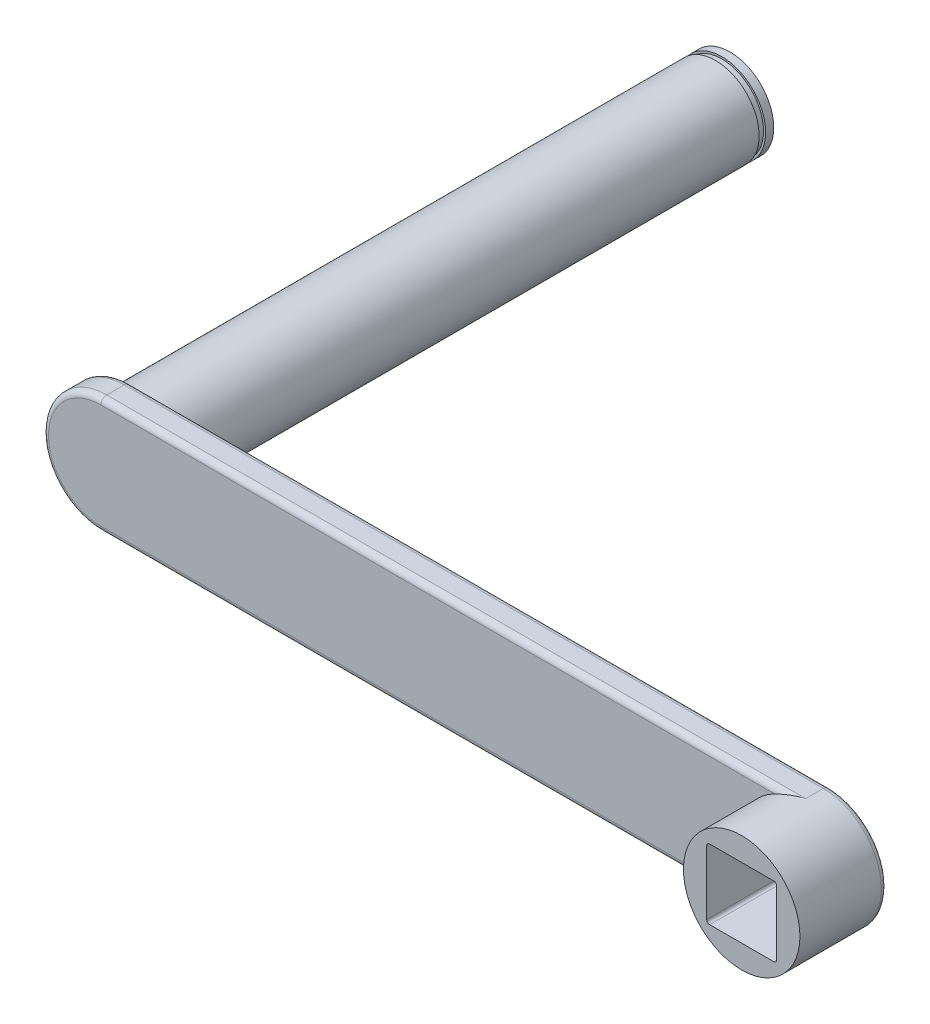
ISO-10303-21;
HEADER;
FILE_DESCRIPTION(('STEP AP214'),'2;1');
FILE_NAME('part.step','',(''),(''),'','','');
FILE_SCHEMA(('AUTOMOTIVE_DESIGN { 1 0 10303 214 1 1 1 1 }'));
ENDSEC;
DATA;
#1=APPLICATION_CONTEXT('core data for automotive mechanical design processes');
#2=APPLICATION_PROTOCOL_DEFINITION('international standard','automotive_design',2000,#1);
#3=PRODUCT_CONTEXT('',#1,'mechanical');
#4=PRODUCT('Part','Part','',(#3));
#5=PRODUCT_RELATED_PRODUCT_CATEGORY('part','',(#4));
#6=PRODUCT_DEFINITION_FORMATION('','',#4);
#7=PRODUCT_DEFINITION_CONTEXT('part definition',#1,'design');
#8=PRODUCT_DEFINITION('design','',#6,#7);
#9=PRODUCT_DEFINITION_SHAPE('','',#8);
#10=(LENGTH_UNIT() NAMED_UNIT(*) SI_UNIT(.MILLI.,.METRE.));
#11=(NAMED_UNIT(*) PLANE_ANGLE_UNIT() SI_UNIT($,.RADIAN.));
#12=(NAMED_UNIT(*) SI_UNIT($,.STERADIAN.) SOLID_ANGLE_UNIT());
#13=UNCERTAINTY_MEASURE_WITH_UNIT(LENGTH_MEASURE(1.E-05),#10,'distance_accuracy_value','');
#14=(GEOMETRIC_REPRESENTATION_CONTEXT(3) GLOBAL_UNCERTAINTY_ASSIGNED_CONTEXT((#13)) GLOBAL_UNIT_ASSIGNED_CONTEXT((#10,
#11,#12)) REPRESENTATION_CONTEXT('',''));
#15=CARTESIAN_POINT('',(0.,0.,0.));
#16=DIRECTION('',(0.,0.,1.));
#17=DIRECTION('',(1.,0.,0.));
#18=AXIS2_PLACEMENT_3D('',#15,#16,#17);
#19=CARTESIAN_POINT('',(-120.,0.,-113.));
#20=DIRECTION('',(0.,0.,1.));
#21=DIRECTION('',(1.,0.,0.));
#22=AXIS2_PLACEMENT_3D('',#19,#20,#21);
#23=CYLINDRICAL_SURFACE('',#22,7.5);
#24=CARTESIAN_POINT('',(-120.,0.,-10.));
#25=DIRECTION('',(0.,0.,-1.));
#26=DIRECTION('',(-1.,0.,0.));
#27=AXIS2_PLACEMENT_3D('',#24,#25,#26);
#28=CIRCLE('',#27,7.5);
#29=CARTESIAN_POINT('',(-127.5,0.,-10.));
#30=VERTEX_POINT('',#29);
#31=EDGE_CURVE('E437',#30,#30,#28,.T.);
#32=ORIENTED_EDGE('',*,*,#31,.T.);
#33=EDGE_LOOP('',(#32));
#34=FACE_BOUND('',#33,.T.);
#35=CARTESIAN_POINT('',(-120.,0.,-110.5));
#36=DIRECTION('',(0.,0.,-1.));
#37=DIRECTION('',(-1.,0.,0.));
#38=AXIS2_PLACEMENT_3D('',#35,#36,#37);
#39=CIRCLE('',#38,7.5);
#40=CARTESIAN_POINT('',(-127.5,0.,-110.5));
#41=VERTEX_POINT('',#40);
#42=EDGE_CURVE('E280',#41,#41,#39,.T.);
#43=ORIENTED_EDGE('',*,*,#42,.F.);
#44=EDGE_LOOP('',(#43));
#45=FACE_BOUND('',#44,.T.);
#46=ADVANCED_FACE('F18',(#34,#45),#23,.T.);
#47=CARTESIAN_POINT('',(0.,0.,5.));
#48=DIRECTION('',(0.,0.,-1.));
#49=DIRECTION('',(-1.,0.,0.));
#50=AXIS2_PLACEMENT_3D('',#47,#48,#49);
#51=CYLINDRICAL_SURFACE('',#50,10.);
#52=CARTESIAN_POINT('',(0.,0.,5.));
#53=DIRECTION('',(0.,0.,1.));
#54=DIRECTION('',(1.,0.,0.));
#55=AXIS2_PLACEMENT_3D('',#52,#53,#54);
#56=CIRCLE('',#55,10.);
#57=CARTESIAN_POINT('',(10.,0.,5.));
#58=VERTEX_POINT('',#57);
#59=EDGE_CURVE('E450',#58,#58,#56,.T.);
#60=ORIENTED_EDGE('',*,*,#59,.F.);
#61=EDGE_LOOP('',(#60));
#62=FACE_BOUND('',#61,.T.);
#63=DIRECTION('',(0.,0.,1.));
#64=VECTOR('',#63,1.);
#65=CARTESIAN_POINT('',(0.,-10.,-10.));
#66=LINE('',#65,#64);
#67=CARTESIAN_POINT('',(0.,-10.,-9.));
#68=VERTEX_POINT('',#67);
#69=CARTESIAN_POINT('',(0.,-10.,-6.));
#70=VERTEX_POINT('',#69);
#71=EDGE_CURVE('E427',#68,#70,#66,.T.);
#72=ORIENTED_EDGE('',*,*,#71,.F.);
#73=CARTESIAN_POINT('',(0.,0.,-9.));
#74=DIRECTION('',(0.,0.,-1.));
#75=DIRECTION('',(-1.,0.,0.));
#76=AXIS2_PLACEMENT_3D('',#73,#74,#75);
#77=CIRCLE('',#76,10.);
#78=CARTESIAN_POINT('',(0.,10.,-9.));
#79=VERTEX_POINT('',#78);
#80=EDGE_CURVE('E142',#68,#79,#77,.F.);
#81=ORIENTED_EDGE('',*,*,#80,.T.);
#82=DIRECTION('',(0.,0.,1.));
#83=VECTOR('',#82,1.);
#84=CARTESIAN_POINT('',(0.,10.,-10.));
#85=LINE('',#84,#83);
#86=CARTESIAN_POINT('',(0.,10.,-6.));
#87=VERTEX_POINT('',#86);
#88=EDGE_CURVE('E425',#79,#87,#85,.T.);
#89=ORIENTED_EDGE('',*,*,#88,.T.);
#90=CARTESIAN_POINT('',(-4.35889894354067,9.,-5.));
#91=CARTESIAN_POINT('',(-4.2865764647807,9.03502940811181,-5.00001517907888));
#92=CARTESIAN_POINT('',(-4.21384835584695,9.06917502615788,-5.00183974990828));
#93=CARTESIAN_POINT('',(-4.06774424773403,9.13563818238745,-5.00867500405916));
#94=CARTESIAN_POINT('',(-3.99436853902,9.16795649634285,-5.01368432408378));
#95=CARTESIAN_POINT('',(-3.84721416016159,9.23067336525732,-5.02644469931919));
#96=CARTESIAN_POINT('',(-3.77343655523181,9.26107554197173,-5.03419038738089));
#97=CARTESIAN_POINT('',(-3.62542416890267,9.32001323089674,-5.05208658188006));
#98=CARTESIAN_POINT('',(-3.55118933283647,9.34854851496683,-5.06223738153229));
#99=CARTESIAN_POINT('',(-3.32854256185863,9.43110737250037,-5.09574919733705));
#100=CARTESIAN_POINT('',(-3.17955672275789,9.482352688623,-5.12222969644671));
#101=CARTESIAN_POINT('',(-2.88046339838335,9.57745203655493,-5.18165298985508));
#102=CARTESIAN_POINT('',(-2.73035525497286,9.62130130647466,-5.21459991820859));
#103=CARTESIAN_POINT('',(-2.36825595348038,9.71798906645472,-5.29987772594522));
#104=CARTESIAN_POINT('',(-2.15587492358611,9.76725305405501,-5.3546487046353));
#105=CARTESIAN_POINT('',(-1.73020697131338,9.85157380993527,-5.47087286474005));
#106=CARTESIAN_POINT('',(-1.5169199178877,9.88662844700476,-5.53232704679307));
#107=CARTESIAN_POINT('',(-0.876019504349692,9.97086857638157,-5.72300296786544));
#108=CARTESIAN_POINT('',(-0.447232906354945,9.99916563253545,-5.858572887852));
#109=CARTESIAN_POINT('',(-0.0127126995627137,9.99999393532312,-5.99597991124585));
#110=CARTESIAN_POINT('',(-0.0063562775510455,9.99999999552881,-5.99798998882368));
#111=CARTESIAN_POINT('',(0.,10.,-6.));
#112=B_SPLINE_CURVE_WITH_KNOTS('',3,(#90,#91,#92,#93,#94,#95,#96,#97,#98,#99,#100,#101,#102,
#103,#104,#105,#106,#107,#108,#109,#110,#111),.UNSPECIFIED.,.F.,.F.,(4,2,2,2,2,2,2,2,2,2,4),(0.,
0.241022397911197,0.481941690674284,0.722391040963471,0.962869720289632,1.44176483881819,
1.92096712310372,2.59465687968437,3.26844764326604,4.61560355969885,4.63560356796335),.UNSPECIFIED.);
#113=CARTESIAN_POINT('',(-4.35889894354067,9.,-5.));
#114=VERTEX_POINT('',#113);
#115=EDGE_CURVE('E203',#87,#114,#112,.F.);
#116=ORIENTED_EDGE('',*,*,#115,.T.);
#117=CARTESIAN_POINT('',(0.,0.,-5.));
#118=DIRECTION('',(0.,0.,-1.));
#119=DIRECTION('',(-1.,0.,0.));
#120=AXIS2_PLACEMENT_3D('',#117,#118,#119);
#121=CIRCLE('',#120,10.);
#122=CARTESIAN_POINT('',(-4.35889894354067,-9.,-5.));
#123=VERTEX_POINT('',#122);
#124=EDGE_CURVE('E446',#123,#114,#121,.T.);
#125=ORIENTED_EDGE('',*,*,#124,.F.);
#126=CARTESIAN_POINT('',(-4.35889894354067,-9.,-5.));
#127=CARTESIAN_POINT('',(-4.2865764647807,-9.03502940811181,-5.00001517907888));
#128=CARTESIAN_POINT('',(-4.21384835584695,-9.06917502615788,-5.00183974990828));
#129=CARTESIAN_POINT('',(-4.06774424773403,-9.13563818238745,-5.00867500405916));
#130=CARTESIAN_POINT('',(-3.99436853902,-9.16795649634285,-5.01368432408378));
#131=CARTESIAN_POINT('',(-3.84721416016159,-9.23067336525732,-5.02644469931919));
#132=CARTESIAN_POINT('',(-3.77343655523181,-9.26107554197173,-5.03419038738089));
#133=CARTESIAN_POINT('',(-3.62542416890267,-9.32001323089674,-5.05208658188006));
#134=CARTESIAN_POINT('',(-3.55118933283647,-9.34854851496683,-5.06223738153229));
#135=CARTESIAN_POINT('',(-3.32854256185863,-9.43110737250037,-5.09574919733705));
#136=CARTESIAN_POINT('',(-3.17955672275789,-9.482352688623,-5.12222969644671));
#137=CARTESIAN_POINT('',(-2.88046339838335,-9.57745203655493,-5.18165298985508));
#138=CARTESIAN_POINT('',(-2.73035525497286,-9.62130130647466,-5.21459991820859));
#139=CARTESIAN_POINT('',(-2.36825595348038,-9.71798906645472,-5.29987772594522));
#140=CARTESIAN_POINT('',(-2.15587492358611,-9.76725305405501,-5.3546487046353));
#141=CARTESIAN_POINT('',(-1.73020697131338,-9.85157380993527,-5.47087286474005));
#142=CARTESIAN_POINT('',(-1.5169199178877,-9.88662844700476,-5.53232704679307));
#143=CARTESIAN_POINT('',(-0.876019504349692,-9.97086857638157,-5.72300296786544));
#144=CARTESIAN_POINT('',(-0.447232906354945,-9.99916563253545,-5.858572887852));
#145=CARTESIAN_POINT('',(-0.0127126995627137,-9.99999393532312,-5.99597991124585));
#146=CARTESIAN_POINT('',(-0.0063562775510455,-9.99999999552881,-5.99798998882368));
#147=CARTESIAN_POINT('',(0.,-10.,-6.));
#148=B_SPLINE_CURVE_WITH_KNOTS('',3,(#126,#127,#128,#129,#130,#131,#132,#133,#134,#135,#136,
#137,#138,#139,#140,#141,#142,#143,#144,#145,#146,#147),.UNSPECIFIED.,.F.,.F.,(4,2,2,2,2,2,2,2,
2,2,4),(0.,0.241022397911197,0.481941690674284,0.722391040963471,0.962869720289632,
1.44176483881819,1.92096712310372,2.59465687968437,3.26844764326604,4.61560355969885,
4.63560356796335),.UNSPECIFIED.);
#149=EDGE_CURVE('E212',#123,#70,#148,.T.);
#150=ORIENTED_EDGE('',*,*,#149,.T.);
#151=EDGE_LOOP('',(#72,#81,#89,#116,#125,#150));
#152=FACE_BOUND('',#151,.T.);
#153=ADVANCED_FACE('F222',(#62,#152),#51,.T.);
#154=CARTESIAN_POINT('',(0.,0.,5.));
#155=DIRECTION('',(0.,0.,1.));
#156=DIRECTION('',(1.,0.,0.));
#157=AXIS2_PLACEMENT_3D('',#154,#155,#156);
#158=PLANE('',#157);
#159=DIRECTION('',(0.,1.,0.));
#160=VECTOR('',#159,1.);
#161=CARTESIAN_POINT('',(6.,-6.,5.));
#162=LINE('',#161,#160);
#163=CARTESIAN_POINT('',(6.,-5.5,5.));
#164=VERTEX_POINT('',#163);
#165=CARTESIAN_POINT('',(6.,5.5,5.));
#166=VERTEX_POINT('',#165);
#167=EDGE_CURVE('E279',#164,#166,#162,.T.);
#168=ORIENTED_EDGE('',*,*,#167,.F.);
#169=CARTESIAN_POINT('',(5.5,-5.5,5.));
#170=DIRECTION('',(0.,0.,1.));
#171=DIRECTION('',(1.,0.,0.));
#172=AXIS2_PLACEMENT_3D('',#169,#170,#171);
#173=CIRCLE('',#172,0.5);
#174=CARTESIAN_POINT('',(5.5,-6.,5.));
#175=VERTEX_POINT('',#174);
#176=EDGE_CURVE('E43',#164,#175,#173,.F.);
#177=ORIENTED_EDGE('',*,*,#176,.T.);
#178=DIRECTION('',(1.,0.,0.));
#179=VECTOR('',#178,1.);
#180=CARTESIAN_POINT('',(-6.,-6.,5.));
#181=LINE('',#180,#179);
#182=CARTESIAN_POINT('',(-5.5,-6.,5.));
#183=VERTEX_POINT('',#182);
#184=EDGE_CURVE('E406',#183,#175,#181,.T.);
#185=ORIENTED_EDGE('',*,*,#184,.F.);
#186=CARTESIAN_POINT('',(-5.5,-5.5,5.));
#187=DIRECTION('',(0.,0.,1.));
#188=DIRECTION('',(1.,0.,0.));
#189=AXIS2_PLACEMENT_3D('',#186,#187,#188);
#190=CIRCLE('',#189,0.5);
#191=CARTESIAN_POINT('',(-6.,-5.5,5.));
#192=VERTEX_POINT('',#191);
#193=EDGE_CURVE('E354',#183,#192,#190,.F.);
#194=ORIENTED_EDGE('',*,*,#193,.T.);
#195=DIRECTION('',(0.,-1.,0.));
#196=VECTOR('',#195,1.);
#197=CARTESIAN_POINT('',(-6.,-6.,5.));
#198=LINE('',#197,#196);
#199=CARTESIAN_POINT('',(-6.,5.5,5.));
#200=VERTEX_POINT('',#199);
#201=EDGE_CURVE('E654',#200,#192,#198,.T.);
#202=ORIENTED_EDGE('',*,*,#201,.F.);
#203=CARTESIAN_POINT('',(-5.5,5.5,5.));
#204=DIRECTION('',(0.,0.,1.));
#205=DIRECTION('',(1.,0.,0.));
#206=AXIS2_PLACEMENT_3D('',#203,#204,#205);
#207=CIRCLE('',#206,0.5);
#208=CARTESIAN_POINT('',(-5.5,6.,5.));
#209=VERTEX_POINT('',#208);
#210=EDGE_CURVE('E348',#200,#209,#207,.F.);
#211=ORIENTED_EDGE('',*,*,#210,.T.);
#212=DIRECTION('',(-1.,0.,0.));
#213=VECTOR('',#212,1.);
#214=CARTESIAN_POINT('',(-6.,6.,5.));
#215=LINE('',#214,#213);
#216=CARTESIAN_POINT('',(5.5,6.,5.));
#217=VERTEX_POINT('',#216);
#218=EDGE_CURVE('E285',#217,#209,#215,.T.);
#219=ORIENTED_EDGE('',*,*,#218,.F.);
#220=CARTESIAN_POINT('',(5.5,5.5,5.));
#221=DIRECTION('',(0.,0.,1.));
#222=DIRECTION('',(1.,0.,0.));
#223=AXIS2_PLACEMENT_3D('',#220,#221,#222);
#224=CIRCLE('',#223,0.5);
#225=EDGE_CURVE('E35',#217,#166,#224,.F.);
#226=ORIENTED_EDGE('',*,*,#225,.T.);
#227=EDGE_LOOP('',(#168,#177,#185,#194,#202,#211,#219,#226));
#228=FACE_BOUND('',#227,.T.);
#229=ORIENTED_EDGE('',*,*,#59,.T.);
#230=EDGE_LOOP('',(#229));
#231=FACE_BOUND('',#230,.T.);
#232=ADVANCED_FACE('F227',(#228,#231),#158,.T.);
#233=CARTESIAN_POINT('',(0.,0.,-5.));
#234=DIRECTION('',(0.,0.,-1.));
#235=DIRECTION('',(-1.,0.,0.));
#236=AXIS2_PLACEMENT_3D('',#233,#234,#235);
#237=PLANE('',#236);
#238=ORIENTED_EDGE('',*,*,#124,.T.);
#239=DIRECTION('',(1.,0.,0.));
#240=VECTOR('',#239,1.);
#241=CARTESIAN_POINT('',(0.,9.,-5.));
#242=LINE('',#241,#240);
#243=CARTESIAN_POINT('',(-120.,9.,-5.));
#244=VERTEX_POINT('',#243);
#245=EDGE_CURVE('E194',#114,#244,#242,.F.);
#246=ORIENTED_EDGE('',*,*,#245,.T.);
#247=CARTESIAN_POINT('',(-120.,0.,-5.));
#248=DIRECTION('',(0.,0.,-1.));
#249=DIRECTION('',(-1.,0.,0.));
#250=AXIS2_PLACEMENT_3D('',#247,#248,#249);
#251=CIRCLE('',#250,9.);
#252=CARTESIAN_POINT('',(-120.,-9.,-5.));
#253=VERTEX_POINT('',#252);
#254=EDGE_CURVE('E191',#244,#253,#251,.F.);
#255=ORIENTED_EDGE('',*,*,#254,.T.);
#256=DIRECTION('',(-1.,0.,0.));
#257=VECTOR('',#256,1.);
#258=CARTESIAN_POINT('',(0.,-9.,-5.));
#259=LINE('',#258,#257);
#260=EDGE_CURVE('E188',#253,#123,#259,.F.);
#261=ORIENTED_EDGE('',*,*,#260,.T.);
#262=EDGE_LOOP('',(#238,#246,#255,#261));
#263=FACE_BOUND('',#262,.T.);
#264=ADVANCED_FACE('F478',(#263),#237,.F.);
#265=CARTESIAN_POINT('',(0.,-10.,-10.));
#266=DIRECTION('',(0.,1.,0.));
#267=DIRECTION('',(0.,0.,1.));
#268=AXIS2_PLACEMENT_3D('',#265,#266,#267);
#269=PLANE('',#268);
#270=DIRECTION('',(0.,0.,1.));
#271=VECTOR('',#270,1.);
#272=CARTESIAN_POINT('',(-120.,-10.,-10.));
#273=LINE('',#272,#271);
#274=CARTESIAN_POINT('',(-120.,-10.,-9.));
#275=VERTEX_POINT('',#274);
#276=CARTESIAN_POINT('',(-120.,-10.,-6.));
#277=VERTEX_POINT('',#276);
#278=EDGE_CURVE('E435',#275,#277,#273,.T.);
#279=ORIENTED_EDGE('',*,*,#278,.F.);
#280=DIRECTION('',(-1.,0.,0.));
#281=VECTOR('',#280,1.);
#282=CARTESIAN_POINT('',(0.,-10.,-9.));
#283=LINE('',#282,#281);
#284=EDGE_CURVE('E200',#275,#68,#283,.F.);
#285=ORIENTED_EDGE('',*,*,#284,.T.);
#286=ORIENTED_EDGE('',*,*,#71,.T.);
#287=DIRECTION('',(-1.,0.,0.));
#288=VECTOR('',#287,1.);
#289=CARTESIAN_POINT('',(0.,-10.,-6.));
#290=LINE('',#289,#288);
#291=EDGE_CURVE('E197',#70,#277,#290,.T.);
#292=ORIENTED_EDGE('',*,*,#291,.T.);
#293=EDGE_LOOP('',(#279,#285,#286,#292));
#294=FACE_BOUND('',#293,.T.);
#295=ADVANCED_FACE('F464',(#294),#269,.F.);
#296=CARTESIAN_POINT('',(-120.,0.,-10.));
#297=DIRECTION('',(0.,0.,1.));
#298=DIRECTION('',(1.,0.,0.));
#299=AXIS2_PLACEMENT_3D('',#296,#297,#298);
#300=CYLINDRICAL_SURFACE('',#299,10.);
#301=DIRECTION('',(0.,0.,1.));
#302=VECTOR('',#301,1.);
#303=CARTESIAN_POINT('',(-120.,10.,-10.));
#304=LINE('',#303,#302);
#305=CARTESIAN_POINT('',(-120.,10.,-9.));
#306=VERTEX_POINT('',#305);
#307=CARTESIAN_POINT('',(-120.,10.,-6.));
#308=VERTEX_POINT('',#307);
#309=EDGE_CURVE('E430',#306,#308,#304,.T.);
#310=ORIENTED_EDGE('',*,*,#309,.F.);
#311=CARTESIAN_POINT('',(-120.,0.,-9.));
#312=DIRECTION('',(0.,0.,-1.));
#313=DIRECTION('',(-1.,0.,0.));
#314=AXIS2_PLACEMENT_3D('',#311,#312,#313);
#315=CIRCLE('',#314,10.);
#316=EDGE_CURVE('E185',#306,#275,#315,.F.);
#317=ORIENTED_EDGE('',*,*,#316,.T.);
#318=ORIENTED_EDGE('',*,*,#278,.T.);
#319=CARTESIAN_POINT('',(-120.,0.,-6.));
#320=DIRECTION('',(0.,0.,-1.));
#321=DIRECTION('',(-1.,0.,0.));
#322=AXIS2_PLACEMENT_3D('',#319,#320,#321);
#323=CIRCLE('',#322,10.);
#324=EDGE_CURVE('E182',#277,#308,#323,.T.);
#325=ORIENTED_EDGE('',*,*,#324,.T.);
#326=EDGE_LOOP('',(#310,#317,#318,#325));
#327=FACE_BOUND('',#326,.T.);
#328=ADVANCED_FACE('F461',(#327),#300,.T.);
#329=CARTESIAN_POINT('',(0.,10.,-10.));
#330=DIRECTION('',(0.,-1.,0.));
#331=DIRECTION('',(0.,0.,-1.));
#332=AXIS2_PLACEMENT_3D('',#329,#330,#331);
#333=PLANE('',#332);
#334=ORIENTED_EDGE('',*,*,#88,.F.);
#335=DIRECTION('',(1.,0.,0.));
#336=VECTOR('',#335,1.);
#337=CARTESIAN_POINT('',(-120.,10.,-9.));
#338=LINE('',#337,#336);
#339=EDGE_CURVE('E179',#79,#306,#338,.F.);
#340=ORIENTED_EDGE('',*,*,#339,.T.);
#341=ORIENTED_EDGE('',*,*,#309,.T.);
#342=DIRECTION('',(1.,0.,0.));
#343=VECTOR('',#342,1.);
#344=CARTESIAN_POINT('',(0.,10.,-6.));
#345=LINE('',#344,#343);
#346=EDGE_CURVE('E171',#308,#87,#345,.T.);
#347=ORIENTED_EDGE('',*,*,#346,.T.);
#348=EDGE_LOOP('',(#334,#340,#341,#347));
#349=FACE_BOUND('',#348,.T.);
#350=ADVANCED_FACE('F247',(#349),#333,.F.);
#351=CARTESIAN_POINT('',(0.,0.,-10.));
#352=DIRECTION('',(0.,0.,-1.));
#353=DIRECTION('',(-1.,0.,0.));
#354=AXIS2_PLACEMENT_3D('',#351,#352,#353);
#355=PLANE('',#354);
#356=DIRECTION('',(0.,-1.,0.));
#357=VECTOR('',#356,1.);
#358=CARTESIAN_POINT('',(6.,0.,-10.));
#359=LINE('',#358,#357);
#360=CARTESIAN_POINT('',(6.,5.5,-10.));
#361=VERTEX_POINT('',#360);
#362=CARTESIAN_POINT('',(6.,-5.5,-10.));
#363=VERTEX_POINT('',#362);
#364=EDGE_CURVE('E384',#361,#363,#359,.T.);
#365=ORIENTED_EDGE('',*,*,#364,.F.);
#366=CARTESIAN_POINT('',(5.5,5.5,-10.));
#367=DIRECTION('',(0.,0.,-1.));
#368=DIRECTION('',(-1.,0.,0.));
#369=AXIS2_PLACEMENT_3D('',#366,#367,#368);
#370=CIRCLE('',#369,0.5);
#371=CARTESIAN_POINT('',(5.5,6.,-10.));
#372=VERTEX_POINT('',#371);
#373=EDGE_CURVE('E338',#361,#372,#370,.F.);
#374=ORIENTED_EDGE('',*,*,#373,.T.);
#375=DIRECTION('',(1.,0.,0.));
#376=VECTOR('',#375,1.);
#377=CARTESIAN_POINT('',(0.,6.,-10.));
#378=LINE('',#377,#376);
#379=CARTESIAN_POINT('',(-5.5,6.,-10.));
#380=VERTEX_POINT('',#379);
#381=EDGE_CURVE('E395',#380,#372,#378,.T.);
#382=ORIENTED_EDGE('',*,*,#381,.F.);
#383=CARTESIAN_POINT('',(-5.5,5.5,-10.));
#384=DIRECTION('',(0.,0.,-1.));
#385=DIRECTION('',(-1.,0.,0.));
#386=AXIS2_PLACEMENT_3D('',#383,#384,#385);
#387=CIRCLE('',#386,0.5);
#388=CARTESIAN_POINT('',(-6.,5.5,-10.));
#389=VERTEX_POINT('',#388);
#390=EDGE_CURVE('E345',#380,#389,#387,.F.);
#391=ORIENTED_EDGE('',*,*,#390,.T.);
#392=DIRECTION('',(0.,1.,0.));
#393=VECTOR('',#392,1.);
#394=CARTESIAN_POINT('',(-6.,0.,-10.));
#395=LINE('',#394,#393);
#396=CARTESIAN_POINT('',(-6.,-5.5,-10.));
#397=VERTEX_POINT('',#396);
#398=EDGE_CURVE('E391',#397,#389,#395,.T.);
#399=ORIENTED_EDGE('',*,*,#398,.F.);
#400=CARTESIAN_POINT('',(-5.5,-5.5,-10.));
#401=DIRECTION('',(0.,0.,-1.));
#402=DIRECTION('',(-1.,0.,0.));
#403=AXIS2_PLACEMENT_3D('',#400,#401,#402);
#404=CIRCLE('',#403,0.5);
#405=CARTESIAN_POINT('',(-5.5,-6.,-10.));
#406=VERTEX_POINT('',#405);
#407=EDGE_CURVE('E351',#397,#406,#404,.F.);
#408=ORIENTED_EDGE('',*,*,#407,.T.);
#409=DIRECTION('',(-1.,0.,0.));
#410=VECTOR('',#409,1.);
#411=CARTESIAN_POINT('',(0.,-6.,-10.));
#412=LINE('',#411,#410);
#413=CARTESIAN_POINT('',(5.5,-6.,-10.));
#414=VERTEX_POINT('',#413);
#415=EDGE_CURVE('E387',#414,#406,#412,.T.);
#416=ORIENTED_EDGE('',*,*,#415,.F.);
#417=CARTESIAN_POINT('',(5.5,-5.5,-10.));
#418=DIRECTION('',(0.,0.,-1.));
#419=DIRECTION('',(-1.,0.,0.));
#420=AXIS2_PLACEMENT_3D('',#417,#418,#419);
#421=CIRCLE('',#420,0.5);
#422=EDGE_CURVE('E327',#414,#363,#421,.F.);
#423=ORIENTED_EDGE('',*,*,#422,.T.);
#424=EDGE_LOOP('',(#365,#374,#382,#391,#399,#408,#416,#423));
#425=FACE_BOUND('',#424,.T.);
#426=DIRECTION('',(1.,0.,0.));
#427=VECTOR('',#426,1.);
#428=CARTESIAN_POINT('',(0.,9.,-10.));
#429=LINE('',#428,#427);
#430=CARTESIAN_POINT('',(-120.,9.,-10.));
#431=VERTEX_POINT('',#430);
#432=CARTESIAN_POINT('',(0.,9.,-10.));
#433=VERTEX_POINT('',#432);
#434=EDGE_CURVE('E163',#431,#433,#429,.T.);
#435=ORIENTED_EDGE('',*,*,#434,.T.);
#436=CARTESIAN_POINT('',(0.,0.,-10.));
#437=DIRECTION('',(0.,0.,-1.));
#438=DIRECTION('',(-1.,0.,0.));
#439=AXIS2_PLACEMENT_3D('',#436,#437,#438);
#440=CIRCLE('',#439,9.);
#441=CARTESIAN_POINT('',(0.,-9.,-10.));
#442=VERTEX_POINT('',#441);
#443=EDGE_CURVE('E140',#433,#442,#440,.T.);
#444=ORIENTED_EDGE('',*,*,#443,.T.);
#445=DIRECTION('',(-1.,0.,0.));
#446=VECTOR('',#445,1.);
#447=CARTESIAN_POINT('',(-120.,-9.,-10.));
#448=LINE('',#447,#446);
#449=CARTESIAN_POINT('',(-120.,-9.,-10.));
#450=VERTEX_POINT('',#449);
#451=EDGE_CURVE('E150',#442,#450,#448,.T.);
#452=ORIENTED_EDGE('',*,*,#451,.T.);
#453=CARTESIAN_POINT('',(-120.,0.,-10.));
#454=DIRECTION('',(0.,0.,-1.));
#455=DIRECTION('',(-1.,0.,0.));
#456=AXIS2_PLACEMENT_3D('',#453,#454,#455);
#457=CIRCLE('',#456,9.);
#458=EDGE_CURVE('E157',#450,#431,#457,.T.);
#459=ORIENTED_EDGE('',*,*,#458,.T.);
#460=EDGE_LOOP('',(#435,#444,#452,#459));
#461=FACE_BOUND('',#460,.T.);
#462=ORIENTED_EDGE('',*,*,#31,.F.);
#463=EDGE_LOOP('',(#462));
#464=FACE_BOUND('',#463,.T.);
#465=ADVANCED_FACE('F160',(#425,#461,#464),#355,.T.);
#466=CARTESIAN_POINT('',(-120.,0.,-9.));
#467=DIRECTION('',(0.,0.,-1.));
#468=DIRECTION('',(-1.,0.,0.));
#469=AXIS2_PLACEMENT_3D('',#466,#467,#468);
#470=TOROIDAL_SURFACE('',#469,9.,1.);
#471=CARTESIAN_POINT('',(-120.,-9.,-9.));
#472=DIRECTION('',(1.,0.,0.));
#473=DIRECTION('',(0.,0.,-1.));
#474=AXIS2_PLACEMENT_3D('',#471,#472,#473);
#475=CIRCLE('',#474,1.);
#476=EDGE_CURVE('E153',#275,#450,#475,.T.);
#477=ORIENTED_EDGE('',*,*,#476,.F.);
#478=ORIENTED_EDGE('',*,*,#316,.F.);
#479=CARTESIAN_POINT('',(-120.,9.,-9.));
#480=DIRECTION('',(1.,0.,0.));
#481=DIRECTION('',(0.,0.,-1.));
#482=AXIS2_PLACEMENT_3D('',#479,#480,#481);
#483=CIRCLE('',#482,1.);
#484=EDGE_CURVE('E407',#431,#306,#483,.T.);
#485=ORIENTED_EDGE('',*,*,#484,.F.);
#486=ORIENTED_EDGE('',*,*,#458,.F.);
#487=EDGE_LOOP('',(#477,#478,#485,#486));
#488=FACE_BOUND('',#487,.T.);
#489=ADVANCED_FACE('F238',(#488),#470,.T.);
#490=CARTESIAN_POINT('',(0.,9.,-9.));
#491=DIRECTION('',(-1.,0.,0.));
#492=DIRECTION('',(0.,0.,1.));
#493=AXIS2_PLACEMENT_3D('',#490,#491,#492);
#494=CYLINDRICAL_SURFACE('',#493,1.);
#495=ORIENTED_EDGE('',*,*,#484,.T.);
#496=ORIENTED_EDGE('',*,*,#339,.F.);
#497=CARTESIAN_POINT('',(0.,9.,-9.));
#498=DIRECTION('',(1.,0.,0.));
#499=DIRECTION('',(0.,0.,-1.));
#500=AXIS2_PLACEMENT_3D('',#497,#498,#499);
#501=CIRCLE('',#500,1.);
#502=EDGE_CURVE('E146',#433,#79,#501,.T.);
#503=ORIENTED_EDGE('',*,*,#502,.F.);
#504=ORIENTED_EDGE('',*,*,#434,.F.);
#505=EDGE_LOOP('',(#495,#496,#503,#504));
#506=FACE_BOUND('',#505,.T.);
#507=ADVANCED_FACE('F236',(#506),#494,.T.);
#508=CARTESIAN_POINT('',(0.,-9.,-9.));
#509=DIRECTION('',(1.,0.,0.));
#510=DIRECTION('',(0.,0.,-1.));
#511=AXIS2_PLACEMENT_3D('',#508,#509,#510);
#512=CYLINDRICAL_SURFACE('',#511,1.);
#513=ORIENTED_EDGE('',*,*,#476,.T.);
#514=ORIENTED_EDGE('',*,*,#451,.F.);
#515=CARTESIAN_POINT('',(0.,-9.,-9.));
#516=DIRECTION('',(1.,0.,0.));
#517=DIRECTION('',(0.,0.,-1.));
#518=AXIS2_PLACEMENT_3D('',#515,#516,#517);
#519=CIRCLE('',#518,1.);
#520=EDGE_CURVE('E136',#68,#442,#519,.T.);
#521=ORIENTED_EDGE('',*,*,#520,.F.);
#522=ORIENTED_EDGE('',*,*,#284,.F.);
#523=EDGE_LOOP('',(#513,#514,#521,#522));
#524=FACE_BOUND('',#523,.T.);
#525=ADVANCED_FACE('F151',(#524),#512,.T.);
#526=CARTESIAN_POINT('',(0.,0.,-9.));
#527=DIRECTION('',(0.,0.,-1.));
#528=DIRECTION('',(-1.,0.,0.));
#529=AXIS2_PLACEMENT_3D('',#526,#527,#528);
#530=TOROIDAL_SURFACE('',#529,9.,1.);
#531=ORIENTED_EDGE('',*,*,#502,.T.);
#532=ORIENTED_EDGE('',*,*,#80,.F.);
#533=ORIENTED_EDGE('',*,*,#520,.T.);
#534=ORIENTED_EDGE('',*,*,#443,.F.);
#535=EDGE_LOOP('',(#531,#532,#533,#534));
#536=FACE_BOUND('',#535,.T.);
#537=ADVANCED_FACE('F138',(#536),#530,.T.);
#538=CARTESIAN_POINT('',(0.,-9.,-6.));
#539=DIRECTION('',(-1.,0.,0.));
#540=DIRECTION('',(0.,0.,1.));
#541=AXIS2_PLACEMENT_3D('',#538,#539,#540);
#542=CYLINDRICAL_SURFACE('',#541,1.);
#543=ORIENTED_EDGE('',*,*,#149,.F.);
#544=ORIENTED_EDGE('',*,*,#260,.F.);
#545=CARTESIAN_POINT('',(-120.,-9.,-6.));
#546=DIRECTION('',(-1.,0.,0.));
#547=DIRECTION('',(0.,0.,1.));
#548=AXIS2_PLACEMENT_3D('',#545,#546,#547);
#549=CIRCLE('',#548,1.);
#550=EDGE_CURVE('E147',#277,#253,#549,.T.);
#551=ORIENTED_EDGE('',*,*,#550,.F.);
#552=ORIENTED_EDGE('',*,*,#291,.F.);
#553=EDGE_LOOP('',(#543,#544,#551,#552));
#554=FACE_BOUND('',#553,.T.);
#555=ADVANCED_FACE('F233',(#554),#542,.T.);
#556=CARTESIAN_POINT('',(-120.,0.,-6.));
#557=DIRECTION('',(0.,0.,-1.));
#558=DIRECTION('',(-1.,0.,0.));
#559=AXIS2_PLACEMENT_3D('',#556,#557,#558);
#560=TOROIDAL_SURFACE('',#559,9.,1.);
#561=ORIENTED_EDGE('',*,*,#550,.T.);
#562=ORIENTED_EDGE('',*,*,#254,.F.);
#563=CARTESIAN_POINT('',(-120.,9.,-6.));
#564=DIRECTION('',(1.,0.,0.));
#565=DIRECTION('',(0.,0.,-1.));
#566=AXIS2_PLACEMENT_3D('',#563,#564,#565);
#567=CIRCLE('',#566,1.);
#568=EDGE_CURVE('E402',#308,#244,#567,.T.);
#569=ORIENTED_EDGE('',*,*,#568,.F.);
#570=ORIENTED_EDGE('',*,*,#324,.F.);
#571=EDGE_LOOP('',(#561,#562,#569,#570));
#572=FACE_BOUND('',#571,.T.);
#573=ADVANCED_FACE('F473',(#572),#560,.T.);
#574=CARTESIAN_POINT('',(0.,9.,-6.));
#575=DIRECTION('',(1.,0.,0.));
#576=DIRECTION('',(0.,0.,-1.));
#577=AXIS2_PLACEMENT_3D('',#574,#575,#576);
#578=CYLINDRICAL_SURFACE('',#577,1.);
#579=ORIENTED_EDGE('',*,*,#568,.T.);
#580=ORIENTED_EDGE('',*,*,#245,.F.);
#581=ORIENTED_EDGE('',*,*,#115,.F.);
#582=ORIENTED_EDGE('',*,*,#346,.F.);
#583=EDGE_LOOP('',(#579,#580,#581,#582));
#584=FACE_BOUND('',#583,.T.);
#585=ADVANCED_FACE('F218',(#584),#578,.T.);
#586=CARTESIAN_POINT('',(6.,-6.,-113.));
#587=DIRECTION('',(1.,0.,0.));
#588=DIRECTION('',(0.,0.,-1.));
#589=AXIS2_PLACEMENT_3D('',#586,#587,#588);
#590=PLANE('',#589);
#591=ORIENTED_EDGE('',*,*,#167,.T.);
#592=DIRECTION('',(0.,0.,1.));
#593=VECTOR('',#592,1.);
#594=CARTESIAN_POINT('',(6.,5.5,-10.));
#595=LINE('',#594,#593);
#596=EDGE_CURVE('E357',#166,#361,#595,.F.);
#597=ORIENTED_EDGE('',*,*,#596,.T.);
#598=ORIENTED_EDGE('',*,*,#364,.T.);
#599=DIRECTION('',(0.,0.,1.));
#600=VECTOR('',#599,1.);
#601=CARTESIAN_POINT('',(6.,-5.5,5.));
#602=LINE('',#601,#600);
#603=EDGE_CURVE('E360',#363,#164,#602,.T.);
#604=ORIENTED_EDGE('',*,*,#603,.T.);
#605=EDGE_LOOP('',(#591,#597,#598,#604));
#606=FACE_BOUND('',#605,.T.);
#607=ADVANCED_FACE('F1184',(#606),#590,.F.);
#608=CARTESIAN_POINT('',(-6.,-6.,-113.));
#609=DIRECTION('',(0.,-1.,0.));
#610=DIRECTION('',(0.,0.,-1.));
#611=AXIS2_PLACEMENT_3D('',#608,#609,#610);
#612=PLANE('',#611);
#613=ORIENTED_EDGE('',*,*,#415,.T.);
#614=DIRECTION('',(0.,0.,1.));
#615=VECTOR('',#614,1.);
#616=CARTESIAN_POINT('',(-5.5,-6.,5.));
#617=LINE('',#616,#615);
#618=EDGE_CURVE('E377',#406,#183,#617,.T.);
#619=ORIENTED_EDGE('',*,*,#618,.T.);
#620=ORIENTED_EDGE('',*,*,#184,.T.);
#621=DIRECTION('',(0.,0.,1.));
#622=VECTOR('',#621,1.);
#623=CARTESIAN_POINT('',(5.5,-6.,-10.));
#624=LINE('',#623,#622);
#625=EDGE_CURVE('E381',#175,#414,#624,.F.);
#626=ORIENTED_EDGE('',*,*,#625,.T.);
#627=EDGE_LOOP('',(#613,#619,#620,#626));
#628=FACE_BOUND('',#627,.T.);
#629=ADVANCED_FACE('F1172',(#628),#612,.F.);
#630=CARTESIAN_POINT('',(-6.,-6.,-113.));
#631=DIRECTION('',(-1.,0.,0.));
#632=DIRECTION('',(0.,0.,1.));
#633=AXIS2_PLACEMENT_3D('',#630,#631,#632);
#634=PLANE('',#633);
#635=ORIENTED_EDGE('',*,*,#201,.T.);
#636=DIRECTION('',(0.,0.,1.));
#637=VECTOR('',#636,1.);
#638=CARTESIAN_POINT('',(-6.,-5.5,-10.));
#639=LINE('',#638,#637);
#640=EDGE_CURVE('E370',#192,#397,#639,.F.);
#641=ORIENTED_EDGE('',*,*,#640,.T.);
#642=ORIENTED_EDGE('',*,*,#398,.T.);
#643=DIRECTION('',(0.,0.,1.));
#644=VECTOR('',#643,1.);
#645=CARTESIAN_POINT('',(-6.,5.5,5.));
#646=LINE('',#645,#644);
#647=EDGE_CURVE('E373',#389,#200,#646,.T.);
#648=ORIENTED_EDGE('',*,*,#647,.T.);
#649=EDGE_LOOP('',(#635,#641,#642,#648));
#650=FACE_BOUND('',#649,.T.);
#651=ADVANCED_FACE('F1160',(#650),#634,.F.);
#652=CARTESIAN_POINT('',(-6.,6.,-113.));
#653=DIRECTION('',(0.,1.,0.));
#654=DIRECTION('',(0.,0.,1.));
#655=AXIS2_PLACEMENT_3D('',#652,#653,#654);
#656=PLANE('',#655);
#657=ORIENTED_EDGE('',*,*,#218,.T.);
#658=DIRECTION('',(0.,0.,1.));
#659=VECTOR('',#658,1.);
#660=CARTESIAN_POINT('',(-5.5,6.,-10.));
#661=LINE('',#660,#659);
#662=EDGE_CURVE('E363',#209,#380,#661,.F.);
#663=ORIENTED_EDGE('',*,*,#662,.T.);
#664=ORIENTED_EDGE('',*,*,#381,.T.);
#665=DIRECTION('',(0.,0.,1.));
#666=VECTOR('',#665,1.);
#667=CARTESIAN_POINT('',(5.5,6.,5.));
#668=LINE('',#667,#666);
#669=EDGE_CURVE('E366',#372,#217,#668,.T.);
#670=ORIENTED_EDGE('',*,*,#669,.T.);
#671=EDGE_LOOP('',(#657,#663,#664,#670));
#672=FACE_BOUND('',#671,.T.);
#673=ADVANCED_FACE('F1148',(#672),#656,.F.);
#674=CARTESIAN_POINT('',(-5.5,-5.5,-113.));
#675=DIRECTION('',(0.,0.,-1.));
#676=DIRECTION('',(-1.,0.,0.));
#677=AXIS2_PLACEMENT_3D('',#674,#675,#676);
#678=CYLINDRICAL_SURFACE('',#677,0.5);
#679=ORIENTED_EDGE('',*,*,#407,.F.);
#680=ORIENTED_EDGE('',*,*,#640,.F.);
#681=ORIENTED_EDGE('',*,*,#193,.F.);
#682=ORIENTED_EDGE('',*,*,#618,.F.);
#683=EDGE_LOOP('',(#679,#680,#681,#682));
#684=FACE_BOUND('',#683,.T.);
#685=ADVANCED_FACE('F1136',(#684),#678,.F.);
#686=CARTESIAN_POINT('',(-5.5,5.5,-113.));
#687=DIRECTION('',(0.,0.,-1.));
#688=DIRECTION('',(-1.,0.,0.));
#689=AXIS2_PLACEMENT_3D('',#686,#687,#688);
#690=CYLINDRICAL_SURFACE('',#689,0.5);
#691=ORIENTED_EDGE('',*,*,#390,.F.);
#692=ORIENTED_EDGE('',*,*,#662,.F.);
#693=ORIENTED_EDGE('',*,*,#210,.F.);
#694=ORIENTED_EDGE('',*,*,#647,.F.);
#695=EDGE_LOOP('',(#691,#692,#693,#694));
#696=FACE_BOUND('',#695,.T.);
#697=ADVANCED_FACE('F1125',(#696),#690,.F.);
#698=CARTESIAN_POINT('',(5.5,5.5,-113.));
#699=DIRECTION('',(0.,0.,-1.));
#700=DIRECTION('',(-1.,0.,0.));
#701=AXIS2_PLACEMENT_3D('',#698,#699,#700);
#702=CYLINDRICAL_SURFACE('',#701,0.5);
#703=ORIENTED_EDGE('',*,*,#373,.F.);
#704=ORIENTED_EDGE('',*,*,#596,.F.);
#705=ORIENTED_EDGE('',*,*,#225,.F.);
#706=ORIENTED_EDGE('',*,*,#669,.F.);
#707=EDGE_LOOP('',(#703,#704,#705,#706));
#708=FACE_BOUND('',#707,.T.);
#709=ADVANCED_FACE('F1115',(#708),#702,.F.);
#710=CARTESIAN_POINT('',(5.5,-5.5,-113.));
#711=DIRECTION('',(0.,0.,-1.));
#712=DIRECTION('',(-1.,0.,0.));
#713=AXIS2_PLACEMENT_3D('',#710,#711,#712);
#714=CYLINDRICAL_SURFACE('',#713,0.5);
#715=ORIENTED_EDGE('',*,*,#422,.F.);
#716=ORIENTED_EDGE('',*,*,#625,.F.);
#717=ORIENTED_EDGE('',*,*,#176,.F.);
#718=ORIENTED_EDGE('',*,*,#603,.F.);
#719=EDGE_LOOP('',(#715,#716,#717,#718));
#720=FACE_BOUND('',#719,.T.);
#721=ADVANCED_FACE('F20',(#720),#714,.F.);
#722=CARTESIAN_POINT('',(-120.,-7.26,-111.6));
#723=DIRECTION('',(0.,0.,1.));
#724=DIRECTION('',(1.,0.,0.));
#725=AXIS2_PLACEMENT_3D('',#722,#723,#724);
#726=PLANE('',#725);
#727=CARTESIAN_POINT('',(-120.,0.,-111.6));
#728=DIRECTION('',(0.,0.,1.));
#729=DIRECTION('',(1.,0.,0.));
#730=AXIS2_PLACEMENT_3D('',#727,#728,#729);
#731=CIRCLE('',#730,7.5);
#732=CARTESIAN_POINT('',(-112.5,0.,-111.6));
#733=VERTEX_POINT('',#732);
#734=EDGE_CURVE('E276',#733,#733,#731,.T.);
#735=ORIENTED_EDGE('',*,*,#734,.T.);
#736=EDGE_LOOP('',(#735));
#737=FACE_BOUND('',#736,.T.);
#738=CARTESIAN_POINT('',(-120.,0.,-111.6));
#739=DIRECTION('',(0.,0.,1.));
#740=DIRECTION('',(1.,0.,0.));
#741=AXIS2_PLACEMENT_3D('',#738,#739,#740);
#742=CIRCLE('',#741,7.15);
#743=CARTESIAN_POINT('',(-112.85,0.,-111.6));
#744=VERTEX_POINT('',#743);
#745=EDGE_CURVE('E28',#744,#744,#742,.F.);
#746=ORIENTED_EDGE('',*,*,#745,.T.);
#747=EDGE_LOOP('',(#746));
#748=FACE_BOUND('',#747,.T.);
#749=ADVANCED_FACE('F1093',(#737,#748),#726,.T.);
#750=CARTESIAN_POINT('',(-120.,-8.99999999999727,-110.5));
#751=DIRECTION('',(0.,0.,-1.));
#752=DIRECTION('',(-1.,0.,0.));
#753=AXIS2_PLACEMENT_3D('',#750,#751,#752);
#754=PLANE('',#753);
#755=ORIENTED_EDGE('',*,*,#42,.T.);
#756=EDGE_LOOP('',(#755));
#757=FACE_BOUND('',#756,.T.);
#758=CARTESIAN_POINT('',(-120.,0.,-110.5));
#759=DIRECTION('',(0.,0.,-1.));
#760=DIRECTION('',(-1.,0.,0.));
#761=AXIS2_PLACEMENT_3D('',#758,#759,#760);
#762=CIRCLE('',#761,7.15);
#763=CARTESIAN_POINT('',(-127.15,0.,-110.5));
#764=VERTEX_POINT('',#763);
#765=EDGE_CURVE('E12',#764,#764,#762,.T.);
#766=ORIENTED_EDGE('',*,*,#765,.F.);
#767=EDGE_LOOP('',(#766));
#768=FACE_BOUND('',#767,.T.);
#769=ADVANCED_FACE('F1081',(#757,#768),#754,.T.);
#770=CARTESIAN_POINT('',(-120.,0.,-113.));
#771=DIRECTION('',(0.,0.,1.));
#772=DIRECTION('',(1.,0.,0.));
#773=AXIS2_PLACEMENT_3D('',#770,#771,#772);
#774=CYLINDRICAL_SURFACE('',#773,7.15);
#775=ORIENTED_EDGE('',*,*,#745,.F.);
#776=EDGE_LOOP('',(#775));
#777=FACE_BOUND('',#776,.T.);
#778=ORIENTED_EDGE('',*,*,#765,.T.);
#779=EDGE_LOOP('',(#778));
#780=FACE_BOUND('',#779,.T.);
#781=ADVANCED_FACE('F1070',(#777,#780),#774,.T.);
#782=CARTESIAN_POINT('',(-120.,0.,-10.));
#783=DIRECTION('',(0.,0.,-1.));
#784=DIRECTION('',(-1.,0.,0.));
#785=AXIS2_PLACEMENT_3D('',#782,#783,#784);
#786=CIRCLE('',#785,5.5);
#787=CARTESIAN_POINT('',(-125.5,0.,-10.));
#788=VERTEX_POINT('',#787);
#789=EDGE_CURVE('E158',#788,#788,#786,.F.);
#790=ORIENTED_EDGE('',*,*,#789,.F.);
#791=EDGE_LOOP('',(#790));
#792=FACE_BOUND('',#791,.T.);
#793=ADVANCED_FACE('F250',(#792),#355,.T.);
#794=CARTESIAN_POINT('',(-120.,0.,-113.));
#795=DIRECTION('',(0.,0.,1.));
#796=DIRECTION('',(1.,0.,0.));
#797=AXIS2_PLACEMENT_3D('',#794,#795,#796);
#798=CYLINDRICAL_SURFACE('',#797,5.5);
#799=CARTESIAN_POINT('',(-120.,0.,-113.));
#800=DIRECTION('',(0.,0.,-1.));
#801=DIRECTION('',(-1.,0.,0.));
#802=AXIS2_PLACEMENT_3D('',#799,#800,#801);
#803=CIRCLE('',#802,5.5);
#804=CARTESIAN_POINT('',(-125.5,0.,-113.));
#805=VERTEX_POINT('',#804);
#806=EDGE_CURVE('E411',#805,#805,#803,.T.);
#807=ORIENTED_EDGE('',*,*,#806,.T.);
#808=EDGE_LOOP('',(#807));
#809=FACE_BOUND('',#808,.T.);
#810=ORIENTED_EDGE('',*,*,#789,.T.);
#811=EDGE_LOOP('',(#810));
#812=FACE_BOUND('',#811,.T.);
#813=ADVANCED_FACE('F268',(#809,#812),#798,.F.);
#814=CARTESIAN_POINT('',(-120.,0.,-113.));
#815=DIRECTION('',(0.,0.,-1.));
#816=DIRECTION('',(-1.,0.,0.));
#817=AXIS2_PLACEMENT_3D('',#814,#815,#816);
#818=PLANE('',#817);
#819=CARTESIAN_POINT('',(-120.,0.,-113.));
#820=DIRECTION('',(0.,0.,-1.));
#821=DIRECTION('',(-1.,0.,0.));
#822=AXIS2_PLACEMENT_3D('',#819,#820,#821);
#823=CIRCLE('',#822,7.5);
#824=CARTESIAN_POINT('',(-127.5,0.,-113.));
#825=VERTEX_POINT('',#824);
#826=EDGE_CURVE('E273',#825,#825,#823,.T.);
#827=ORIENTED_EDGE('',*,*,#826,.T.);
#828=EDGE_LOOP('',(#827));
#829=FACE_BOUND('',#828,.T.);
#830=ORIENTED_EDGE('',*,*,#806,.F.);
#831=EDGE_LOOP('',(#830));
#832=FACE_BOUND('',#831,.T.);
#833=ADVANCED_FACE('F262',(#829,#832),#818,.T.);
#834=ORIENTED_EDGE('',*,*,#826,.F.);
#835=EDGE_LOOP('',(#834));
#836=FACE_BOUND('',#835,.T.);
#837=ORIENTED_EDGE('',*,*,#734,.F.);
#838=EDGE_LOOP('',(#837));
#839=FACE_BOUND('',#838,.T.);
#840=ADVANCED_FACE('F254',(#836,#839),#23,.T.);
#841=CLOSED_SHELL('',(#46,#153,#232,#264,#295,#328,#350,#465,#489,#507,#525,#537,#555,#573,#585,
#607,#629,#651,#673,#685,#697,#709,#721,#749,#769,#781,#793,#813,#833,#840));
#842=MANIFOLD_SOLID_BREP('B1',#841);
#843=ADVANCED_BREP_SHAPE_REPRESENTATION('',(#18,#842),#14);
#844=SHAPE_DEFINITION_REPRESENTATION(#9,#843);
ENDSEC;
END-ISO-10303-21;
